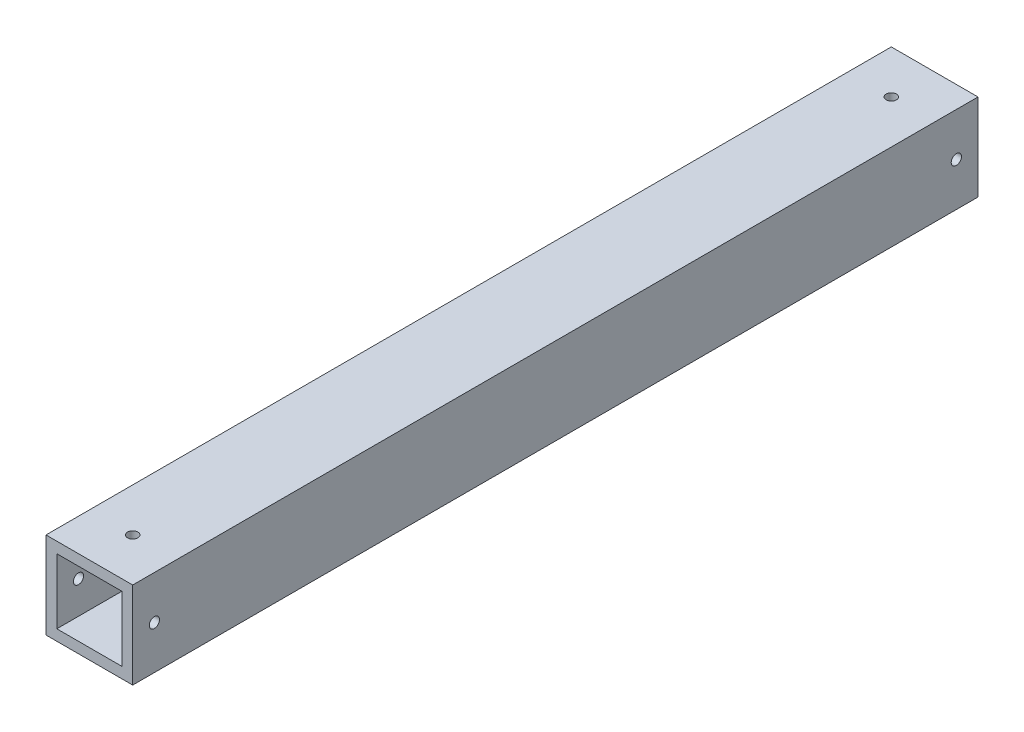
ISO-10303-21;
HEADER;
FILE_DESCRIPTION(('STEP AP214'),'2;1');
FILE_NAME('part.step','',(''),(''),'','','');
FILE_SCHEMA(('AUTOMOTIVE_DESIGN { 1 0 10303 214 1 1 1 1 }'));
ENDSEC;
DATA;
#1=APPLICATION_CONTEXT('core data for automotive mechanical design processes');
#2=APPLICATION_PROTOCOL_DEFINITION('international standard','automotive_design',2000,#1);
#3=PRODUCT_CONTEXT('',#1,'mechanical');
#4=PRODUCT('Part','Part','',(#3));
#5=PRODUCT_RELATED_PRODUCT_CATEGORY('part','',(#4));
#6=PRODUCT_DEFINITION_FORMATION('','',#4);
#7=PRODUCT_DEFINITION_CONTEXT('part definition',#1,'design');
#8=PRODUCT_DEFINITION('design','',#6,#7);
#9=PRODUCT_DEFINITION_SHAPE('','',#8);
#10=(LENGTH_UNIT() NAMED_UNIT(*) SI_UNIT(.MILLI.,.METRE.));
#11=(NAMED_UNIT(*) PLANE_ANGLE_UNIT() SI_UNIT($,.RADIAN.));
#12=(NAMED_UNIT(*) SI_UNIT($,.STERADIAN.) SOLID_ANGLE_UNIT());
#13=UNCERTAINTY_MEASURE_WITH_UNIT(LENGTH_MEASURE(1.E-05),#10,'distance_accuracy_value','');
#14=(GEOMETRIC_REPRESENTATION_CONTEXT(3) GLOBAL_UNCERTAINTY_ASSIGNED_CONTEXT((#13)) GLOBAL_UNIT_ASSIGNED_CONTEXT((#10,
#11,#12)) REPRESENTATION_CONTEXT('',''));
#15=CARTESIAN_POINT('',(0.,0.,0.));
#16=DIRECTION('',(0.,0.,1.));
#17=DIRECTION('',(1.,0.,0.));
#18=AXIS2_PLACEMENT_3D('',#15,#16,#17);
#19=CARTESIAN_POINT('',(0.,0.,247.65));
#20=DIRECTION('',(0.,0.,-1.));
#21=DIRECTION('',(-1.,0.,0.));
#22=AXIS2_PLACEMENT_3D('',#19,#20,#21);
#23=PLANE('',#22);
#24=DIRECTION('',(0.,1.,0.));
#25=VECTOR('',#24,1.);
#26=CARTESIAN_POINT('',(12.7,-12.7,247.65));
#27=LINE('',#26,#25);
#28=CARTESIAN_POINT('',(12.7,-12.7,247.65));
#29=VERTEX_POINT('',#28);
#30=CARTESIAN_POINT('',(12.7,12.7,247.65));
#31=VERTEX_POINT('',#30);
#32=EDGE_CURVE('E148',#29,#31,#27,.T.);
#33=ORIENTED_EDGE('',*,*,#32,.T.);
#34=DIRECTION('',(-1.,0.,0.));
#35=VECTOR('',#34,1.);
#36=CARTESIAN_POINT('',(-12.7,12.7,247.65));
#37=LINE('',#36,#35);
#38=CARTESIAN_POINT('',(-12.7,12.7,247.65));
#39=VERTEX_POINT('',#38);
#40=EDGE_CURVE('E151',#31,#39,#37,.T.);
#41=ORIENTED_EDGE('',*,*,#40,.T.);
#42=DIRECTION('',(0.,-1.,0.));
#43=VECTOR('',#42,1.);
#44=CARTESIAN_POINT('',(-12.7,-12.7,247.65));
#45=LINE('',#44,#43);
#46=CARTESIAN_POINT('',(-12.7,-12.7,247.65));
#47=VERTEX_POINT('',#46);
#48=EDGE_CURVE('E154',#39,#47,#45,.T.);
#49=ORIENTED_EDGE('',*,*,#48,.T.);
#50=DIRECTION('',(1.,0.,0.));
#51=VECTOR('',#50,1.);
#52=CARTESIAN_POINT('',(-12.7,-12.7,247.65));
#53=LINE('',#52,#51);
#54=EDGE_CURVE('E156',#47,#29,#53,.T.);
#55=ORIENTED_EDGE('',*,*,#54,.T.);
#56=EDGE_LOOP('',(#33,#41,#49,#55));
#57=FACE_BOUND('',#56,.T.);
#58=DIRECTION('',(0.,1.,0.));
#59=VECTOR('',#58,1.);
#60=CARTESIAN_POINT('',(9.525,-9.525,247.65));
#61=LINE('',#60,#59);
#62=CARTESIAN_POINT('',(9.525,-9.525,247.65));
#63=VERTEX_POINT('',#62);
#64=CARTESIAN_POINT('',(9.525,9.525,247.65));
#65=VERTEX_POINT('',#64);
#66=EDGE_CURVE('E110',#63,#65,#61,.T.);
#67=ORIENTED_EDGE('',*,*,#66,.F.);
#68=DIRECTION('',(1.,0.,0.));
#69=VECTOR('',#68,1.);
#70=CARTESIAN_POINT('',(-9.525,-9.525,247.65));
#71=LINE('',#70,#69);
#72=CARTESIAN_POINT('',(-9.525,-9.525,247.65));
#73=VERTEX_POINT('',#72);
#74=EDGE_CURVE('E132',#73,#63,#71,.T.);
#75=ORIENTED_EDGE('',*,*,#74,.F.);
#76=DIRECTION('',(0.,-1.,0.));
#77=VECTOR('',#76,1.);
#78=CARTESIAN_POINT('',(-9.525,-9.525,247.65));
#79=LINE('',#78,#77);
#80=CARTESIAN_POINT('',(-9.525,9.525,247.65));
#81=VERTEX_POINT('',#80);
#82=EDGE_CURVE('E130',#81,#73,#79,.T.);
#83=ORIENTED_EDGE('',*,*,#82,.F.);
#84=DIRECTION('',(-1.,0.,0.));
#85=VECTOR('',#84,1.);
#86=CARTESIAN_POINT('',(-9.525,9.525,247.65));
#87=LINE('',#86,#85);
#88=EDGE_CURVE('E118',#65,#81,#87,.T.);
#89=ORIENTED_EDGE('',*,*,#88,.F.);
#90=EDGE_LOOP('',(#67,#75,#83,#89));
#91=FACE_BOUND('',#90,.T.);
#92=ADVANCED_FACE('F43',(#57,#91),#23,.F.);
#93=CARTESIAN_POINT('',(0.,0.,0.));
#94=DIRECTION('',(0.,0.,-1.));
#95=DIRECTION('',(-1.,0.,0.));
#96=AXIS2_PLACEMENT_3D('',#93,#94,#95);
#97=PLANE('',#96);
#98=DIRECTION('',(0.,1.,0.));
#99=VECTOR('',#98,1.);
#100=CARTESIAN_POINT('',(12.7,-12.7,0.));
#101=LINE('',#100,#99);
#102=CARTESIAN_POINT('',(12.7,-12.7,0.));
#103=VERTEX_POINT('',#102);
#104=CARTESIAN_POINT('',(12.7,12.7,0.));
#105=VERTEX_POINT('',#104);
#106=EDGE_CURVE('E126',#103,#105,#101,.T.);
#107=ORIENTED_EDGE('',*,*,#106,.F.);
#108=DIRECTION('',(1.,0.,0.));
#109=VECTOR('',#108,1.);
#110=CARTESIAN_POINT('',(-12.7,-12.7,0.));
#111=LINE('',#110,#109);
#112=CARTESIAN_POINT('',(-12.7,-12.7,0.));
#113=VERTEX_POINT('',#112);
#114=EDGE_CURVE('E152',#113,#103,#111,.T.);
#115=ORIENTED_EDGE('',*,*,#114,.F.);
#116=DIRECTION('',(0.,-1.,0.));
#117=VECTOR('',#116,1.);
#118=CARTESIAN_POINT('',(-12.7,-12.7,0.));
#119=LINE('',#118,#117);
#120=CARTESIAN_POINT('',(-12.7,12.7,0.));
#121=VERTEX_POINT('',#120);
#122=EDGE_CURVE('E163',#121,#113,#119,.T.);
#123=ORIENTED_EDGE('',*,*,#122,.F.);
#124=DIRECTION('',(-1.,0.,0.));
#125=VECTOR('',#124,1.);
#126=CARTESIAN_POINT('',(-12.7,12.7,0.));
#127=LINE('',#126,#125);
#128=EDGE_CURVE('E161',#105,#121,#127,.T.);
#129=ORIENTED_EDGE('',*,*,#128,.F.);
#130=EDGE_LOOP('',(#107,#115,#123,#129));
#131=FACE_BOUND('',#130,.T.);
#132=DIRECTION('',(1.,0.,0.));
#133=VECTOR('',#132,1.);
#134=CARTESIAN_POINT('',(-9.525,-9.525,0.));
#135=LINE('',#134,#133);
#136=CARTESIAN_POINT('',(-9.525,-9.525,0.));
#137=VERTEX_POINT('',#136);
#138=CARTESIAN_POINT('',(9.525,-9.525,0.));
#139=VERTEX_POINT('',#138);
#140=EDGE_CURVE('E119',#137,#139,#135,.T.);
#141=ORIENTED_EDGE('',*,*,#140,.T.);
#142=DIRECTION('',(0.,1.,0.));
#143=VECTOR('',#142,1.);
#144=CARTESIAN_POINT('',(9.525,-9.525,0.));
#145=LINE('',#144,#143);
#146=CARTESIAN_POINT('',(9.525,9.525,0.));
#147=VERTEX_POINT('',#146);
#148=EDGE_CURVE('E68',#139,#147,#145,.T.);
#149=ORIENTED_EDGE('',*,*,#148,.T.);
#150=DIRECTION('',(-1.,0.,0.));
#151=VECTOR('',#150,1.);
#152=CARTESIAN_POINT('',(-9.525,9.525,0.));
#153=LINE('',#152,#151);
#154=CARTESIAN_POINT('',(-9.525,9.525,0.));
#155=VERTEX_POINT('',#154);
#156=EDGE_CURVE('E125',#147,#155,#153,.T.);
#157=ORIENTED_EDGE('',*,*,#156,.T.);
#158=DIRECTION('',(0.,-1.,0.));
#159=VECTOR('',#158,1.);
#160=CARTESIAN_POINT('',(-9.525,-9.525,0.));
#161=LINE('',#160,#159);
#162=EDGE_CURVE('E140',#155,#137,#161,.T.);
#163=ORIENTED_EDGE('',*,*,#162,.T.);
#164=EDGE_LOOP('',(#141,#149,#157,#163));
#165=FACE_BOUND('',#164,.T.);
#166=ADVANCED_FACE('F236',(#131,#165),#97,.T.);
#167=CARTESIAN_POINT('',(12.7,-12.7,247.65));
#168=DIRECTION('',(-1.,0.,0.));
#169=DIRECTION('',(0.,0.,1.));
#170=AXIS2_PLACEMENT_3D('',#167,#168,#169);
#171=PLANE('',#170);
#172=CARTESIAN_POINT('',(12.7,0.,6.35));
#173=DIRECTION('',(1.,0.,0.));
#174=DIRECTION('',(0.,0.,-1.));
#175=AXIS2_PLACEMENT_3D('',#172,#173,#174);
#176=CIRCLE('',#175,1.5);
#177=CARTESIAN_POINT('',(12.7,0.,4.85));
#178=VERTEX_POINT('',#177);
#179=EDGE_CURVE('E181',#178,#178,#176,.T.);
#180=ORIENTED_EDGE('',*,*,#179,.F.);
#181=EDGE_LOOP('',(#180));
#182=FACE_BOUND('',#181,.T.);
#183=CARTESIAN_POINT('',(12.7,0.,241.3));
#184=DIRECTION('',(1.,0.,0.));
#185=DIRECTION('',(0.,0.,-1.));
#186=AXIS2_PLACEMENT_3D('',#183,#184,#185);
#187=CIRCLE('',#186,1.5);
#188=CARTESIAN_POINT('',(12.7,0.,239.8));
#189=VERTEX_POINT('',#188);
#190=EDGE_CURVE('E177',#189,#189,#187,.T.);
#191=ORIENTED_EDGE('',*,*,#190,.F.);
#192=EDGE_LOOP('',(#191));
#193=FACE_BOUND('',#192,.T.);
#194=ORIENTED_EDGE('',*,*,#106,.T.);
#195=DIRECTION('',(0.,0.,-1.));
#196=VECTOR('',#195,1.);
#197=CARTESIAN_POINT('',(12.7,12.7,247.65));
#198=LINE('',#197,#196);
#199=EDGE_CURVE('E11',#31,#105,#198,.T.);
#200=ORIENTED_EDGE('',*,*,#199,.F.);
#201=ORIENTED_EDGE('',*,*,#32,.F.);
#202=DIRECTION('',(0.,0.,-1.));
#203=VECTOR('',#202,1.);
#204=CARTESIAN_POINT('',(12.7,-12.7,247.65));
#205=LINE('',#204,#203);
#206=EDGE_CURVE('E158',#29,#103,#205,.T.);
#207=ORIENTED_EDGE('',*,*,#206,.T.);
#208=EDGE_LOOP('',(#194,#200,#201,#207));
#209=FACE_BOUND('',#208,.T.);
#210=ADVANCED_FACE('F45',(#182,#193,#209),#171,.F.);
#211=CARTESIAN_POINT('',(-12.7,12.7,247.65));
#212=DIRECTION('',(0.,-1.,0.));
#213=DIRECTION('',(0.,0.,-1.));
#214=AXIS2_PLACEMENT_3D('',#211,#212,#213);
#215=PLANE('',#214);
#216=CARTESIAN_POINT('',(0.,12.7,234.95));
#217=DIRECTION('',(0.,1.,0.));
#218=DIRECTION('',(0.,0.,1.));
#219=AXIS2_PLACEMENT_3D('',#216,#217,#218);
#220=CIRCLE('',#219,1.5);
#221=CARTESIAN_POINT('',(0.,12.7,236.45));
#222=VERTEX_POINT('',#221);
#223=EDGE_CURVE('E263',#222,#222,#220,.T.);
#224=ORIENTED_EDGE('',*,*,#223,.F.);
#225=EDGE_LOOP('',(#224));
#226=FACE_BOUND('',#225,.T.);
#227=CARTESIAN_POINT('',(0.,12.7,12.7));
#228=DIRECTION('',(0.,1.,0.));
#229=DIRECTION('',(0.,0.,1.));
#230=AXIS2_PLACEMENT_3D('',#227,#228,#229);
#231=CIRCLE('',#230,1.5);
#232=CARTESIAN_POINT('',(0.,12.7,14.2));
#233=VERTEX_POINT('',#232);
#234=EDGE_CURVE('E185',#233,#233,#231,.T.);
#235=ORIENTED_EDGE('',*,*,#234,.F.);
#236=EDGE_LOOP('',(#235));
#237=FACE_BOUND('',#236,.T.);
#238=ORIENTED_EDGE('',*,*,#128,.T.);
#239=DIRECTION('',(0.,0.,-1.));
#240=VECTOR('',#239,1.);
#241=CARTESIAN_POINT('',(-12.7,12.7,247.65));
#242=LINE('',#241,#240);
#243=EDGE_CURVE('E52',#39,#121,#242,.T.);
#244=ORIENTED_EDGE('',*,*,#243,.F.);
#245=ORIENTED_EDGE('',*,*,#40,.F.);
#246=ORIENTED_EDGE('',*,*,#199,.T.);
#247=EDGE_LOOP('',(#238,#244,#245,#246));
#248=FACE_BOUND('',#247,.T.);
#249=ADVANCED_FACE('F252',(#226,#237,#248),#215,.F.);
#250=CARTESIAN_POINT('',(-12.7,-12.7,247.65));
#251=DIRECTION('',(1.,0.,0.));
#252=DIRECTION('',(0.,0.,-1.));
#253=AXIS2_PLACEMENT_3D('',#250,#251,#252);
#254=PLANE('',#253);
#255=CARTESIAN_POINT('',(-12.7,0.,6.35));
#256=DIRECTION('',(1.,0.,0.));
#257=DIRECTION('',(0.,0.,-1.));
#258=AXIS2_PLACEMENT_3D('',#255,#256,#257);
#259=CIRCLE('',#258,1.5);
#260=CARTESIAN_POINT('',(-12.7,0.,4.85));
#261=VERTEX_POINT('',#260);
#262=EDGE_CURVE('E207',#261,#261,#259,.T.);
#263=ORIENTED_EDGE('',*,*,#262,.T.);
#264=EDGE_LOOP('',(#263));
#265=FACE_BOUND('',#264,.T.);
#266=CARTESIAN_POINT('',(-12.7,0.,241.3));
#267=DIRECTION('',(1.,0.,0.));
#268=DIRECTION('',(0.,0.,-1.));
#269=AXIS2_PLACEMENT_3D('',#266,#267,#268);
#270=CIRCLE('',#269,1.5);
#271=CARTESIAN_POINT('',(-12.7,0.,239.8));
#272=VERTEX_POINT('',#271);
#273=EDGE_CURVE('E138',#272,#272,#270,.T.);
#274=ORIENTED_EDGE('',*,*,#273,.T.);
#275=EDGE_LOOP('',(#274));
#276=FACE_BOUND('',#275,.T.);
#277=ORIENTED_EDGE('',*,*,#122,.T.);
#278=DIRECTION('',(0.,0.,-1.));
#279=VECTOR('',#278,1.);
#280=CARTESIAN_POINT('',(-12.7,-12.7,247.65));
#281=LINE('',#280,#279);
#282=EDGE_CURVE('E168',#47,#113,#281,.T.);
#283=ORIENTED_EDGE('',*,*,#282,.F.);
#284=ORIENTED_EDGE('',*,*,#48,.F.);
#285=ORIENTED_EDGE('',*,*,#243,.T.);
#286=EDGE_LOOP('',(#277,#283,#284,#285));
#287=FACE_BOUND('',#286,.T.);
#288=ADVANCED_FACE('F216',(#265,#276,#287),#254,.F.);
#289=CARTESIAN_POINT('',(-12.7,-12.7,247.65));
#290=DIRECTION('',(0.,1.,0.));
#291=DIRECTION('',(0.,0.,1.));
#292=AXIS2_PLACEMENT_3D('',#289,#290,#291);
#293=PLANE('',#292);
#294=CARTESIAN_POINT('',(0.,-12.7,234.95));
#295=DIRECTION('',(0.,1.,0.));
#296=DIRECTION('',(0.,0.,1.));
#297=AXIS2_PLACEMENT_3D('',#294,#295,#296);
#298=CIRCLE('',#297,1.5);
#299=CARTESIAN_POINT('',(0.,-12.7,236.45));
#300=VERTEX_POINT('',#299);
#301=EDGE_CURVE('E192',#300,#300,#298,.T.);
#302=ORIENTED_EDGE('',*,*,#301,.T.);
#303=EDGE_LOOP('',(#302));
#304=FACE_BOUND('',#303,.T.);
#305=CARTESIAN_POINT('',(0.,-12.7,12.7));
#306=DIRECTION('',(0.,1.,0.));
#307=DIRECTION('',(0.,0.,1.));
#308=AXIS2_PLACEMENT_3D('',#305,#306,#307);
#309=CIRCLE('',#308,1.5);
#310=CARTESIAN_POINT('',(0.,-12.7,14.2));
#311=VERTEX_POINT('',#310);
#312=EDGE_CURVE('E189',#311,#311,#309,.T.);
#313=ORIENTED_EDGE('',*,*,#312,.T.);
#314=EDGE_LOOP('',(#313));
#315=FACE_BOUND('',#314,.T.);
#316=ORIENTED_EDGE('',*,*,#114,.T.);
#317=ORIENTED_EDGE('',*,*,#206,.F.);
#318=ORIENTED_EDGE('',*,*,#54,.F.);
#319=ORIENTED_EDGE('',*,*,#282,.T.);
#320=EDGE_LOOP('',(#316,#317,#318,#319));
#321=FACE_BOUND('',#320,.T.);
#322=ADVANCED_FACE('F247',(#304,#315,#321),#293,.F.);
#323=CARTESIAN_POINT('',(9.525,-9.525,247.65));
#324=DIRECTION('',(-1.,0.,0.));
#325=DIRECTION('',(0.,0.,1.));
#326=AXIS2_PLACEMENT_3D('',#323,#324,#325);
#327=PLANE('',#326);
#328=CARTESIAN_POINT('',(9.52500000000001,0.,6.35));
#329=DIRECTION('',(-1.,0.,0.));
#330=DIRECTION('',(0.,0.,1.));
#331=AXIS2_PLACEMENT_3D('',#328,#329,#330);
#332=CIRCLE('',#331,1.5);
#333=CARTESIAN_POINT('',(9.52500000000001,0.,7.85));
#334=VERTEX_POINT('',#333);
#335=EDGE_CURVE('E180',#334,#334,#332,.T.);
#336=ORIENTED_EDGE('',*,*,#335,.F.);
#337=EDGE_LOOP('',(#336));
#338=FACE_BOUND('',#337,.T.);
#339=CARTESIAN_POINT('',(9.52500000000001,0.,241.3));
#340=DIRECTION('',(-1.,0.,0.));
#341=DIRECTION('',(0.,0.,1.));
#342=AXIS2_PLACEMENT_3D('',#339,#340,#341);
#343=CIRCLE('',#342,1.5);
#344=CARTESIAN_POINT('',(9.52500000000001,0.,242.8));
#345=VERTEX_POINT('',#344);
#346=EDGE_CURVE('E176',#345,#345,#343,.T.);
#347=ORIENTED_EDGE('',*,*,#346,.F.);
#348=EDGE_LOOP('',(#347));
#349=FACE_BOUND('',#348,.T.);
#350=ORIENTED_EDGE('',*,*,#148,.F.);
#351=DIRECTION('',(0.,0.,-1.));
#352=VECTOR('',#351,1.);
#353=CARTESIAN_POINT('',(9.525,-9.525,247.65));
#354=LINE('',#353,#352);
#355=EDGE_CURVE('E114',#63,#139,#354,.T.);
#356=ORIENTED_EDGE('',*,*,#355,.F.);
#357=ORIENTED_EDGE('',*,*,#66,.T.);
#358=DIRECTION('',(0.,0.,-1.));
#359=VECTOR('',#358,1.);
#360=CARTESIAN_POINT('',(9.525,9.525,247.65));
#361=LINE('',#360,#359);
#362=EDGE_CURVE('E113',#65,#147,#361,.T.);
#363=ORIENTED_EDGE('',*,*,#362,.T.);
#364=EDGE_LOOP('',(#350,#356,#357,#363));
#365=FACE_BOUND('',#364,.T.);
#366=ADVANCED_FACE('F112',(#338,#349,#365),#327,.T.);
#367=CARTESIAN_POINT('',(-9.525,9.525,247.65));
#368=DIRECTION('',(0.,-1.,0.));
#369=DIRECTION('',(0.,0.,-1.));
#370=AXIS2_PLACEMENT_3D('',#367,#368,#369);
#371=PLANE('',#370);
#372=CARTESIAN_POINT('',(0.,9.52500000000001,234.95));
#373=DIRECTION('',(0.,-1.,0.));
#374=DIRECTION('',(0.,0.,-1.));
#375=AXIS2_PLACEMENT_3D('',#372,#373,#374);
#376=CIRCLE('',#375,1.5);
#377=CARTESIAN_POINT('',(0.,9.52500000000001,233.45));
#378=VERTEX_POINT('',#377);
#379=EDGE_CURVE('E197',#378,#378,#376,.T.);
#380=ORIENTED_EDGE('',*,*,#379,.F.);
#381=EDGE_LOOP('',(#380));
#382=FACE_BOUND('',#381,.T.);
#383=CARTESIAN_POINT('',(0.,9.52500000000001,12.7));
#384=DIRECTION('',(0.,-1.,0.));
#385=DIRECTION('',(0.,0.,-1.));
#386=AXIS2_PLACEMENT_3D('',#383,#384,#385);
#387=CIRCLE('',#386,1.5);
#388=CARTESIAN_POINT('',(0.,9.52500000000001,11.2));
#389=VERTEX_POINT('',#388);
#390=EDGE_CURVE('E184',#389,#389,#387,.T.);
#391=ORIENTED_EDGE('',*,*,#390,.F.);
#392=EDGE_LOOP('',(#391));
#393=FACE_BOUND('',#392,.T.);
#394=ORIENTED_EDGE('',*,*,#156,.F.);
#395=ORIENTED_EDGE('',*,*,#362,.F.);
#396=ORIENTED_EDGE('',*,*,#88,.T.);
#397=DIRECTION('',(0.,0.,-1.));
#398=VECTOR('',#397,1.);
#399=CARTESIAN_POINT('',(-9.525,9.525,247.65));
#400=LINE('',#399,#398);
#401=EDGE_CURVE('E127',#81,#155,#400,.T.);
#402=ORIENTED_EDGE('',*,*,#401,.T.);
#403=EDGE_LOOP('',(#394,#395,#396,#402));
#404=FACE_BOUND('',#403,.T.);
#405=ADVANCED_FACE('F122',(#382,#393,#404),#371,.T.);
#406=CARTESIAN_POINT('',(-9.525,-9.525,247.65));
#407=DIRECTION('',(1.,0.,0.));
#408=DIRECTION('',(0.,0.,-1.));
#409=AXIS2_PLACEMENT_3D('',#406,#407,#408);
#410=PLANE('',#409);
#411=CARTESIAN_POINT('',(-9.52500000000001,0.,6.35));
#412=DIRECTION('',(1.,0.,0.));
#413=DIRECTION('',(0.,0.,-1.));
#414=AXIS2_PLACEMENT_3D('',#411,#412,#413);
#415=CIRCLE('',#414,1.5);
#416=CARTESIAN_POINT('',(-9.52500000000001,0.,4.85));
#417=VERTEX_POINT('',#416);
#418=EDGE_CURVE('E178',#417,#417,#415,.T.);
#419=ORIENTED_EDGE('',*,*,#418,.F.);
#420=EDGE_LOOP('',(#419));
#421=FACE_BOUND('',#420,.T.);
#422=CARTESIAN_POINT('',(-9.52500000000001,0.,241.3));
#423=DIRECTION('',(1.,0.,0.));
#424=DIRECTION('',(0.,0.,-1.));
#425=AXIS2_PLACEMENT_3D('',#422,#423,#424);
#426=CIRCLE('',#425,1.5);
#427=CARTESIAN_POINT('',(-9.52500000000001,0.,239.8));
#428=VERTEX_POINT('',#427);
#429=EDGE_CURVE('E173',#428,#428,#426,.T.);
#430=ORIENTED_EDGE('',*,*,#429,.F.);
#431=EDGE_LOOP('',(#430));
#432=FACE_BOUND('',#431,.T.);
#433=ORIENTED_EDGE('',*,*,#162,.F.);
#434=ORIENTED_EDGE('',*,*,#401,.F.);
#435=ORIENTED_EDGE('',*,*,#82,.T.);
#436=DIRECTION('',(0.,0.,-1.));
#437=VECTOR('',#436,1.);
#438=CARTESIAN_POINT('',(-9.525,-9.525,247.65));
#439=LINE('',#438,#437);
#440=EDGE_CURVE('E60',#73,#137,#439,.T.);
#441=ORIENTED_EDGE('',*,*,#440,.T.);
#442=EDGE_LOOP('',(#433,#434,#435,#441));
#443=FACE_BOUND('',#442,.T.);
#444=ADVANCED_FACE('F231',(#421,#432,#443),#410,.T.);
#445=CARTESIAN_POINT('',(-9.525,-9.525,247.65));
#446=DIRECTION('',(0.,1.,0.));
#447=DIRECTION('',(0.,0.,1.));
#448=AXIS2_PLACEMENT_3D('',#445,#446,#447);
#449=PLANE('',#448);
#450=CARTESIAN_POINT('',(0.,-9.52500000000001,234.95));
#451=DIRECTION('',(0.,1.,0.));
#452=DIRECTION('',(0.,0.,1.));
#453=AXIS2_PLACEMENT_3D('',#450,#451,#452);
#454=CIRCLE('',#453,1.5);
#455=CARTESIAN_POINT('',(0.,-9.52500000000001,236.45));
#456=VERTEX_POINT('',#455);
#457=EDGE_CURVE('E47',#456,#456,#454,.T.);
#458=ORIENTED_EDGE('',*,*,#457,.F.);
#459=EDGE_LOOP('',(#458));
#460=FACE_BOUND('',#459,.T.);
#461=CARTESIAN_POINT('',(0.,-9.52500000000001,12.7));
#462=DIRECTION('',(0.,1.,0.));
#463=DIRECTION('',(0.,0.,1.));
#464=AXIS2_PLACEMENT_3D('',#461,#462,#463);
#465=CIRCLE('',#464,1.5);
#466=CARTESIAN_POINT('',(0.,-9.52500000000001,14.2));
#467=VERTEX_POINT('',#466);
#468=EDGE_CURVE('E182',#467,#467,#465,.T.);
#469=ORIENTED_EDGE('',*,*,#468,.F.);
#470=EDGE_LOOP('',(#469));
#471=FACE_BOUND('',#470,.T.);
#472=ORIENTED_EDGE('',*,*,#140,.F.);
#473=ORIENTED_EDGE('',*,*,#440,.F.);
#474=ORIENTED_EDGE('',*,*,#74,.T.);
#475=ORIENTED_EDGE('',*,*,#355,.T.);
#476=EDGE_LOOP('',(#472,#473,#474,#475));
#477=FACE_BOUND('',#476,.T.);
#478=ADVANCED_FACE('F222',(#460,#471,#477),#449,.T.);
#479=CARTESIAN_POINT('',(-241.3,0.,241.3));
#480=DIRECTION('',(1.,0.,0.));
#481=DIRECTION('',(0.,0.,-1.));
#482=AXIS2_PLACEMENT_3D('',#479,#480,#481);
#483=CYLINDRICAL_SURFACE('',#482,1.5);
#484=ORIENTED_EDGE('',*,*,#429,.T.);
#485=EDGE_LOOP('',(#484));
#486=FACE_BOUND('',#485,.T.);
#487=ORIENTED_EDGE('',*,*,#273,.F.);
#488=EDGE_LOOP('',(#487));
#489=FACE_BOUND('',#488,.T.);
#490=ADVANCED_FACE('F219',(#486,#489),#483,.F.);
#491=ORIENTED_EDGE('',*,*,#346,.T.);
#492=EDGE_LOOP('',(#491));
#493=FACE_BOUND('',#492,.T.);
#494=ORIENTED_EDGE('',*,*,#190,.T.);
#495=EDGE_LOOP('',(#494));
#496=FACE_BOUND('',#495,.T.);
#497=ADVANCED_FACE('F221',(#493,#496),#483,.F.);
#498=CARTESIAN_POINT('',(-241.3,0.,6.35));
#499=DIRECTION('',(1.,0.,0.));
#500=DIRECTION('',(0.,0.,-1.));
#501=AXIS2_PLACEMENT_3D('',#498,#499,#500);
#502=CYLINDRICAL_SURFACE('',#501,1.5);
#503=ORIENTED_EDGE('',*,*,#418,.T.);
#504=EDGE_LOOP('',(#503));
#505=FACE_BOUND('',#504,.T.);
#506=ORIENTED_EDGE('',*,*,#262,.F.);
#507=EDGE_LOOP('',(#506));
#508=FACE_BOUND('',#507,.T.);
#509=ADVANCED_FACE('F229',(#505,#508),#502,.F.);
#510=ORIENTED_EDGE('',*,*,#335,.T.);
#511=EDGE_LOOP('',(#510));
#512=FACE_BOUND('',#511,.T.);
#513=ORIENTED_EDGE('',*,*,#179,.T.);
#514=EDGE_LOOP('',(#513));
#515=FACE_BOUND('',#514,.T.);
#516=ADVANCED_FACE('F293',(#512,#515),#502,.F.);
#517=CARTESIAN_POINT('',(0.,-241.3,12.7));
#518=DIRECTION('',(0.,1.,0.));
#519=DIRECTION('',(0.,0.,1.));
#520=AXIS2_PLACEMENT_3D('',#517,#518,#519);
#521=CYLINDRICAL_SURFACE('',#520,1.5);
#522=ORIENTED_EDGE('',*,*,#468,.T.);
#523=EDGE_LOOP('',(#522));
#524=FACE_BOUND('',#523,.T.);
#525=ORIENTED_EDGE('',*,*,#312,.F.);
#526=EDGE_LOOP('',(#525));
#527=FACE_BOUND('',#526,.T.);
#528=ADVANCED_FACE('F298',(#524,#527),#521,.F.);
#529=ORIENTED_EDGE('',*,*,#390,.T.);
#530=EDGE_LOOP('',(#529));
#531=FACE_BOUND('',#530,.T.);
#532=ORIENTED_EDGE('',*,*,#234,.T.);
#533=EDGE_LOOP('',(#532));
#534=FACE_BOUND('',#533,.T.);
#535=ADVANCED_FACE('F303',(#531,#534),#521,.F.);
#536=CARTESIAN_POINT('',(0.,-241.3,234.95));
#537=DIRECTION('',(0.,1.,0.));
#538=DIRECTION('',(0.,0.,1.));
#539=AXIS2_PLACEMENT_3D('',#536,#537,#538);
#540=CYLINDRICAL_SURFACE('',#539,1.5);
#541=ORIENTED_EDGE('',*,*,#457,.T.);
#542=EDGE_LOOP('',(#541));
#543=FACE_BOUND('',#542,.T.);
#544=ORIENTED_EDGE('',*,*,#301,.F.);
#545=EDGE_LOOP('',(#544));
#546=FACE_BOUND('',#545,.T.);
#547=ADVANCED_FACE('F304',(#543,#546),#540,.F.);
#548=ORIENTED_EDGE('',*,*,#379,.T.);
#549=EDGE_LOOP('',(#548));
#550=FACE_BOUND('',#549,.T.);
#551=ORIENTED_EDGE('',*,*,#223,.T.);
#552=EDGE_LOOP('',(#551));
#553=FACE_BOUND('',#552,.T.);
#554=ADVANCED_FACE('F306',(#550,#553),#540,.F.);
#555=CLOSED_SHELL('',(#92,#166,#210,#249,#288,#322,#366,#405,#444,#478,#490,#497,#509,#516,#528,
#535,#547,#554));
#556=MANIFOLD_SOLID_BREP('B2',#555);
#557=ADVANCED_BREP_SHAPE_REPRESENTATION('',(#18,#556),#14);
#558=SHAPE_DEFINITION_REPRESENTATION(#9,#557);
ENDSEC;
END-ISO-10303-21;
